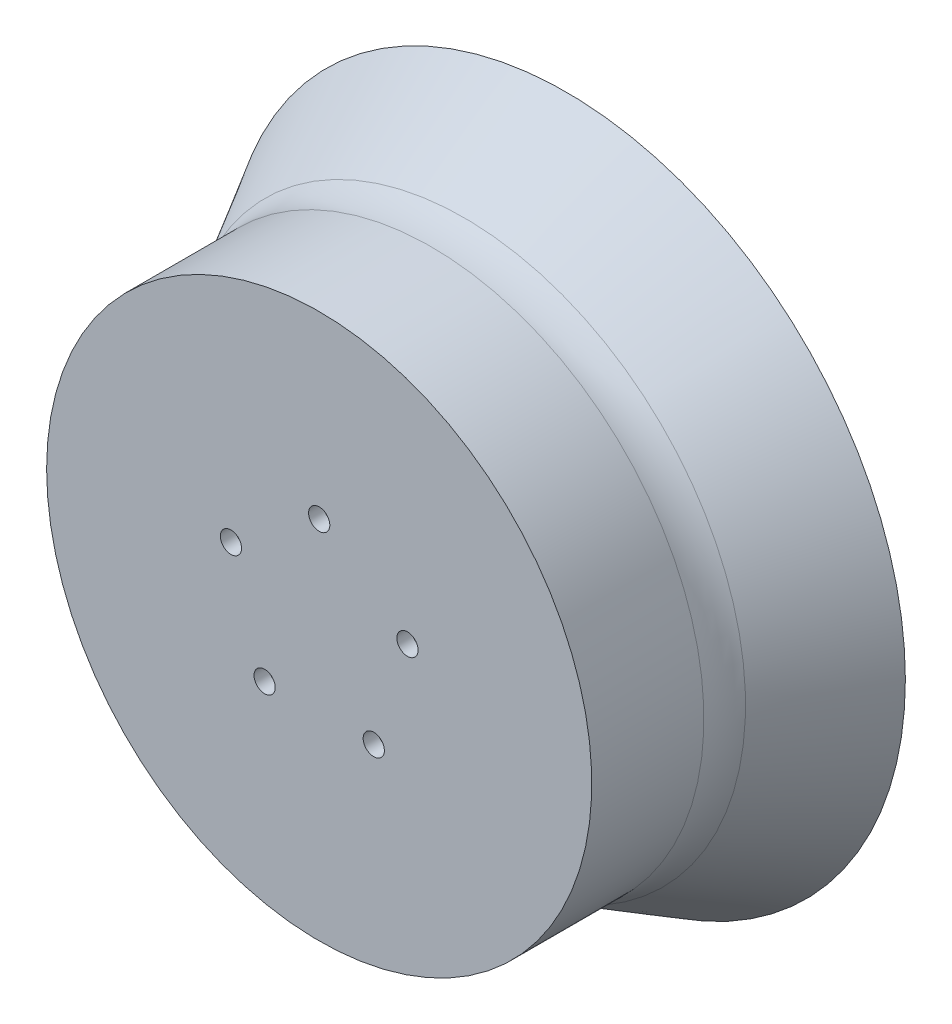
ISO-10303-21;
HEADER;
FILE_DESCRIPTION(('STEP AP214'),'2;1');
FILE_NAME('part.step','',(''),(''),'','','');
FILE_SCHEMA(('AUTOMOTIVE_DESIGN { 1 0 10303 214 1 1 1 1 }'));
ENDSEC;
DATA;
#1=APPLICATION_CONTEXT('core data for automotive mechanical design processes');
#2=APPLICATION_PROTOCOL_DEFINITION('international standard','automotive_design',2000,#1);
#3=PRODUCT_CONTEXT('',#1,'mechanical');
#4=PRODUCT('Part','Part','',(#3));
#5=PRODUCT_RELATED_PRODUCT_CATEGORY('part','',(#4));
#6=PRODUCT_DEFINITION_FORMATION('','',#4);
#7=PRODUCT_DEFINITION_CONTEXT('part definition',#1,'design');
#8=PRODUCT_DEFINITION('design','',#6,#7);
#9=PRODUCT_DEFINITION_SHAPE('','',#8);
#10=(LENGTH_UNIT() NAMED_UNIT(*) SI_UNIT(.MILLI.,.METRE.));
#11=(NAMED_UNIT(*) PLANE_ANGLE_UNIT() SI_UNIT($,.RADIAN.));
#12=(NAMED_UNIT(*) SI_UNIT($,.STERADIAN.) SOLID_ANGLE_UNIT());
#13=UNCERTAINTY_MEASURE_WITH_UNIT(LENGTH_MEASURE(1.E-05),#10,'distance_accuracy_value','');
#14=(GEOMETRIC_REPRESENTATION_CONTEXT(3) GLOBAL_UNCERTAINTY_ASSIGNED_CONTEXT((#13)) GLOBAL_UNIT_ASSIGNED_CONTEXT((#10,
#11,#12)) REPRESENTATION_CONTEXT('',''));
#15=CARTESIAN_POINT('',(0.,0.,0.));
#16=DIRECTION('',(0.,0.,1.));
#17=DIRECTION('',(1.,0.,0.));
#18=AXIS2_PLACEMENT_3D('',#15,#16,#17);
#19=CARTESIAN_POINT('',(0.,0.,4.72888005241665E-12));
#20=DIRECTION('',(0.,0.,-1.));
#21=DIRECTION('',(-1.,0.,0.));
#22=AXIS2_PLACEMENT_3D('',#19,#20,#21);
#23=CYLINDRICAL_SURFACE('',#22,44.45);
#24=CARTESIAN_POINT('',(0.,0.,25.4));
#25=DIRECTION('',(0.,0.,-1.));
#26=DIRECTION('',(-1.,0.,0.));
#27=AXIS2_PLACEMENT_3D('',#24,#25,#26);
#28=CIRCLE('',#27,44.45);
#29=CARTESIAN_POINT('',(-44.45,0.,25.4));
#30=VERTEX_POINT('',#29);
#31=EDGE_CURVE('E69',#30,#30,#28,.T.);
#32=ORIENTED_EDGE('',*,*,#31,.F.);
#33=EDGE_LOOP('',(#32));
#34=FACE_BOUND('',#33,.T.);
#35=CARTESIAN_POINT('',(0.,0.,0.));
#36=DIRECTION('',(0.,0.,-1.));
#37=DIRECTION('',(-1.,0.,0.));
#38=AXIS2_PLACEMENT_3D('',#35,#36,#37);
#39=CIRCLE('',#38,44.45);
#40=CARTESIAN_POINT('',(-44.45,0.,0.));
#41=VERTEX_POINT('',#40);
#42=EDGE_CURVE('E10',#41,#41,#39,.T.);
#43=ORIENTED_EDGE('',*,*,#42,.T.);
#44=EDGE_LOOP('',(#43));
#45=FACE_BOUND('',#44,.T.);
#46=ADVANCED_FACE('F39',(#34,#45),#23,.F.);
#47=CARTESIAN_POINT('',(44.45,0.,0.));
#48=DIRECTION('',(0.,0.,1.));
#49=DIRECTION('',(1.,0.,0.));
#50=AXIS2_PLACEMENT_3D('',#47,#48,#49);
#51=PLANE('',#50);
#52=ORIENTED_EDGE('',*,*,#42,.F.);
#53=EDGE_LOOP('',(#52));
#54=FACE_BOUND('',#53,.T.);
#55=CARTESIAN_POINT('',(0.,0.,0.));
#56=DIRECTION('',(0.,0.,-1.));
#57=DIRECTION('',(-1.,0.,0.));
#58=AXIS2_PLACEMENT_3D('',#55,#56,#57);
#59=CIRCLE('',#58,46.99);
#60=CARTESIAN_POINT('',(-46.99,0.,0.));
#61=VERTEX_POINT('',#60);
#62=EDGE_CURVE('E46',#61,#61,#59,.T.);
#63=ORIENTED_EDGE('',*,*,#62,.T.);
#64=EDGE_LOOP('',(#63));
#65=FACE_BOUND('',#64,.T.);
#66=ADVANCED_FACE('F134',(#54,#65),#51,.F.);
#67=CARTESIAN_POINT('',(0.,0.,-14.6339739445125));
#68=DIRECTION('',(0.,0.,-1.));
#69=DIRECTION('',(-1.,0.,0.));
#70=AXIS2_PLACEMENT_3D('',#67,#68,#69);
#71=CONICAL_SURFACE('',#70,58.473357526,0.665345105019983);
#72=ORIENTED_EDGE('',*,*,#62,.F.);
#73=EDGE_LOOP('',(#72));
#74=FACE_BOUND('',#73,.T.);
#75=CARTESIAN_POINT('',(0.,0.,-14.6339739445125));
#76=DIRECTION('',(0.,0.,-1.));
#77=DIRECTION('',(-1.,0.,0.));
#78=AXIS2_PLACEMENT_3D('',#75,#76,#77);
#79=CIRCLE('',#78,58.473357526);
#80=CARTESIAN_POINT('',(-58.473357526,0.,-14.6339739445125));
#81=VERTEX_POINT('',#80);
#82=EDGE_CURVE('E51',#81,#81,#79,.T.);
#83=ORIENTED_EDGE('',*,*,#82,.T.);
#84=EDGE_LOOP('',(#83));
#85=FACE_BOUND('',#84,.T.);
#86=ADVANCED_FACE('F100',(#74,#85),#71,.F.);
#87=CARTESIAN_POINT('',(0.,0.,2.93998396000001));
#88=DIRECTION('',(0.,0.,-1.));
#89=DIRECTION('',(-1.,0.,0.));
#90=AXIS2_PLACEMENT_3D('',#87,#88,#89);
#91=CONICAL_SURFACE('',#90,48.4888960022749,0.51666322785809);
#92=ORIENTED_EDGE('',*,*,#82,.F.);
#93=EDGE_LOOP('',(#92));
#94=FACE_BOUND('',#93,.T.);
#95=CARTESIAN_POINT('',(0.,0.,2.93998396000001));
#96=DIRECTION('',(0.,0.,-1.));
#97=DIRECTION('',(-1.,0.,0.));
#98=AXIS2_PLACEMENT_3D('',#95,#96,#97);
#99=CIRCLE('',#98,48.4888960022749);
#100=CARTESIAN_POINT('',(-48.4888960022749,0.,2.93998396000001));
#101=VERTEX_POINT('',#100);
#102=EDGE_CURVE('E95',#101,#101,#99,.T.);
#103=ORIENTED_EDGE('',*,*,#102,.T.);
#104=EDGE_LOOP('',(#103));
#105=FACE_BOUND('',#104,.T.);
#106=ADVANCED_FACE('F102',(#94,#105),#91,.T.);
#107=CARTESIAN_POINT('',(0.,0.,8.61255199848089));
#108=DIRECTION('',(0.,0.,-1.));
#109=DIRECTION('',(-1.,0.,0.));
#110=AXIS2_PLACEMENT_3D('',#107,#108,#109);
#111=TOROIDAL_SURFACE('',#110,58.473357526,11.483357526);
#112=ORIENTED_EDGE('',*,*,#102,.F.);
#113=EDGE_LOOP('',(#112));
#114=FACE_BOUND('',#113,.T.);
#115=CARTESIAN_POINT('',(0.,0.,8.61255199848089));
#116=DIRECTION('',(0.,0.,-1.));
#117=DIRECTION('',(-1.,0.,0.));
#118=AXIS2_PLACEMENT_3D('',#115,#116,#117);
#119=CIRCLE('',#118,46.99);
#120=CARTESIAN_POINT('',(-46.99,0.,8.61255199848089));
#121=VERTEX_POINT('',#120);
#122=EDGE_CURVE('E92',#121,#121,#119,.T.);
#123=ORIENTED_EDGE('',*,*,#122,.T.);
#124=EDGE_LOOP('',(#123));
#125=FACE_BOUND('',#124,.T.);
#126=ADVANCED_FACE('F105',(#114,#125),#111,.F.);
#127=CARTESIAN_POINT('',(0.,0.,4.72888005241665E-12));
#128=DIRECTION('',(0.,0.,-1.));
#129=DIRECTION('',(-1.,0.,0.));
#130=AXIS2_PLACEMENT_3D('',#127,#128,#129);
#131=CYLINDRICAL_SURFACE('',#130,46.99);
#132=ORIENTED_EDGE('',*,*,#122,.F.);
#133=EDGE_LOOP('',(#132));
#134=FACE_BOUND('',#133,.T.);
#135=CARTESIAN_POINT('',(0.,0.,27.94));
#136=DIRECTION('',(0.,0.,-1.));
#137=DIRECTION('',(-1.,0.,0.));
#138=AXIS2_PLACEMENT_3D('',#135,#136,#137);
#139=CIRCLE('',#138,46.99);
#140=CARTESIAN_POINT('',(-46.99,0.,27.94));
#141=VERTEX_POINT('',#140);
#142=EDGE_CURVE('E89',#141,#141,#139,.T.);
#143=ORIENTED_EDGE('',*,*,#142,.T.);
#144=EDGE_LOOP('',(#143));
#145=FACE_BOUND('',#144,.T.);
#146=ADVANCED_FACE('F111',(#134,#145),#131,.T.);
#147=CARTESIAN_POINT('',(0.,0.,27.94));
#148=DIRECTION('',(0.,0.,-1.));
#149=DIRECTION('',(-1.,0.,0.));
#150=AXIS2_PLACEMENT_3D('',#147,#148,#149);
#151=PLANE('',#150);
#152=CARTESIAN_POINT('',(-15.2169042607225,4.94427190999912,27.94));
#153=DIRECTION('',(0.,0.,1.));
#154=DIRECTION('',(1.,0.,0.));
#155=AXIS2_PLACEMENT_3D('',#152,#153,#154);
#156=CIRCLE('',#155,1.8288);
#157=CARTESIAN_POINT('',(-13.3881042607225,4.94427190999912,27.94));
#158=VERTEX_POINT('',#157);
#159=EDGE_CURVE('E59',#158,#158,#156,.T.);
#160=ORIENTED_EDGE('',*,*,#159,.F.);
#161=EDGE_LOOP('',(#160));
#162=FACE_BOUND('',#161,.T.);
#163=CARTESIAN_POINT('',(0.,16.,27.94));
#164=DIRECTION('',(0.,0.,1.));
#165=DIRECTION('',(1.,0.,0.));
#166=AXIS2_PLACEMENT_3D('',#163,#164,#165);
#167=CIRCLE('',#166,1.8288);
#168=CARTESIAN_POINT('',(1.8288,16.,27.94));
#169=VERTEX_POINT('',#168);
#170=EDGE_CURVE('E333',#169,#169,#167,.T.);
#171=ORIENTED_EDGE('',*,*,#170,.F.);
#172=EDGE_LOOP('',(#171));
#173=FACE_BOUND('',#172,.T.);
#174=CARTESIAN_POINT('',(-9.4045640366795,-12.9442719099992,27.94));
#175=DIRECTION('',(0.,0.,1.));
#176=DIRECTION('',(1.,0.,0.));
#177=AXIS2_PLACEMENT_3D('',#174,#175,#176);
#178=CIRCLE('',#177,1.8288);
#179=CARTESIAN_POINT('',(-7.5757640366795,-12.9442719099992,27.94));
#180=VERTEX_POINT('',#179);
#181=EDGE_CURVE('E336',#180,#180,#178,.T.);
#182=ORIENTED_EDGE('',*,*,#181,.F.);
#183=EDGE_LOOP('',(#182));
#184=FACE_BOUND('',#183,.T.);
#185=CARTESIAN_POINT('',(9.40456403667968,-12.9442719099991,27.94));
#186=DIRECTION('',(0.,0.,1.));
#187=DIRECTION('',(1.,0.,0.));
#188=AXIS2_PLACEMENT_3D('',#185,#186,#187);
#189=CIRCLE('',#188,1.8288);
#190=CARTESIAN_POINT('',(11.2333640366797,-12.9442719099991,27.94));
#191=VERTEX_POINT('',#190);
#192=EDGE_CURVE('E340',#191,#191,#189,.T.);
#193=ORIENTED_EDGE('',*,*,#192,.F.);
#194=EDGE_LOOP('',(#193));
#195=FACE_BOUND('',#194,.T.);
#196=CARTESIAN_POINT('',(15.2169042607224,4.94427190999933,27.94));
#197=DIRECTION('',(0.,0.,1.));
#198=DIRECTION('',(1.,0.,0.));
#199=AXIS2_PLACEMENT_3D('',#196,#197,#198);
#200=CIRCLE('',#199,1.8288);
#201=CARTESIAN_POINT('',(17.0457042607224,4.94427190999933,27.94));
#202=VERTEX_POINT('',#201);
#203=EDGE_CURVE('E81',#202,#202,#200,.T.);
#204=ORIENTED_EDGE('',*,*,#203,.F.);
#205=EDGE_LOOP('',(#204));
#206=FACE_BOUND('',#205,.T.);
#207=ORIENTED_EDGE('',*,*,#142,.F.);
#208=EDGE_LOOP('',(#207));
#209=FACE_BOUND('',#208,.T.);
#210=ADVANCED_FACE('F117',(#162,#173,#184,#195,#206,#209),#151,.F.);
#211=CARTESIAN_POINT('',(5.4229,0.,15.24));
#212=DIRECTION('',(0.,0.,1.));
#213=DIRECTION('',(1.,0.,0.));
#214=AXIS2_PLACEMENT_3D('',#211,#212,#213);
#215=PLANE('',#214);
#216=CARTESIAN_POINT('',(0.,0.,15.24));
#217=DIRECTION('',(0.,0.,-1.));
#218=DIRECTION('',(-1.,0.,0.));
#219=AXIS2_PLACEMENT_3D('',#216,#217,#218);
#220=CIRCLE('',#219,5.4229);
#221=CARTESIAN_POINT('',(-5.4229,0.,15.24));
#222=VERTEX_POINT('',#221);
#223=EDGE_CURVE('E86',#222,#222,#220,.T.);
#224=ORIENTED_EDGE('',*,*,#223,.T.);
#225=EDGE_LOOP('',(#224));
#226=FACE_BOUND('',#225,.T.);
#227=ADVANCED_FACE('F122',(#226),#215,.F.);
#228=CARTESIAN_POINT('',(0.,0.,17.78));
#229=DIRECTION('',(0.,0.,1.));
#230=DIRECTION('',(1.,0.,0.));
#231=AXIS2_PLACEMENT_3D('',#228,#229,#230);
#232=CONICAL_SURFACE('',#231,7.9629,0.785398163397444);
#233=ORIENTED_EDGE('',*,*,#223,.F.);
#234=EDGE_LOOP('',(#233));
#235=FACE_BOUND('',#234,.T.);
#236=CARTESIAN_POINT('',(0.,0.,17.78));
#237=DIRECTION('',(0.,0.,-1.));
#238=DIRECTION('',(-1.,0.,0.));
#239=AXIS2_PLACEMENT_3D('',#236,#237,#238);
#240=CIRCLE('',#239,7.9629);
#241=CARTESIAN_POINT('',(-7.9629,0.,17.78));
#242=VERTEX_POINT('',#241);
#243=EDGE_CURVE('E78',#242,#242,#240,.T.);
#244=ORIENTED_EDGE('',*,*,#243,.T.);
#245=EDGE_LOOP('',(#244));
#246=FACE_BOUND('',#245,.T.);
#247=ADVANCED_FACE('F128',(#235,#246),#232,.T.);
#248=CARTESIAN_POINT('',(0.,0.,4.72888005241665E-12));
#249=DIRECTION('',(0.,0.,-1.));
#250=DIRECTION('',(-1.,0.,0.));
#251=AXIS2_PLACEMENT_3D('',#248,#249,#250);
#252=CYLINDRICAL_SURFACE('',#251,7.9629);
#253=ORIENTED_EDGE('',*,*,#243,.F.);
#254=EDGE_LOOP('',(#253));
#255=FACE_BOUND('',#254,.T.);
#256=CARTESIAN_POINT('',(0.,0.,25.4));
#257=DIRECTION('',(0.,0.,-1.));
#258=DIRECTION('',(-1.,0.,0.));
#259=AXIS2_PLACEMENT_3D('',#256,#257,#258);
#260=CIRCLE('',#259,7.9629);
#261=CARTESIAN_POINT('',(-7.96289999999999,0.,25.4));
#262=VERTEX_POINT('',#261);
#263=EDGE_CURVE('E73',#262,#262,#260,.T.);
#264=ORIENTED_EDGE('',*,*,#263,.T.);
#265=EDGE_LOOP('',(#264));
#266=FACE_BOUND('',#265,.T.);
#267=ADVANCED_FACE('F182',(#255,#266),#252,.T.);
#268=CARTESIAN_POINT('',(7.9629,0.,25.4));
#269=DIRECTION('',(0.,0.,1.));
#270=DIRECTION('',(1.,0.,0.));
#271=AXIS2_PLACEMENT_3D('',#268,#269,#270);
#272=PLANE('',#271);
#273=CARTESIAN_POINT('',(-15.2169042607225,4.94427190999912,25.4));
#274=DIRECTION('',(0.,0.,1.));
#275=DIRECTION('',(1.,0.,0.));
#276=AXIS2_PLACEMENT_3D('',#273,#274,#275);
#277=CIRCLE('',#276,1.8288);
#278=CARTESIAN_POINT('',(-13.3881042607225,4.94427190999912,25.4));
#279=VERTEX_POINT('',#278);
#280=EDGE_CURVE('E42',#279,#279,#277,.T.);
#281=ORIENTED_EDGE('',*,*,#280,.T.);
#282=EDGE_LOOP('',(#281));
#283=FACE_BOUND('',#282,.T.);
#284=CARTESIAN_POINT('',(0.,16.,25.4));
#285=DIRECTION('',(0.,0.,1.));
#286=DIRECTION('',(1.,0.,0.));
#287=AXIS2_PLACEMENT_3D('',#284,#285,#286);
#288=CIRCLE('',#287,1.8288);
#289=CARTESIAN_POINT('',(1.8288,16.,25.4));
#290=VERTEX_POINT('',#289);
#291=EDGE_CURVE('E64',#290,#290,#288,.T.);
#292=ORIENTED_EDGE('',*,*,#291,.T.);
#293=EDGE_LOOP('',(#292));
#294=FACE_BOUND('',#293,.T.);
#295=CARTESIAN_POINT('',(-9.4045640366795,-12.9442719099992,25.4));
#296=DIRECTION('',(0.,0.,1.));
#297=DIRECTION('',(1.,0.,0.));
#298=AXIS2_PLACEMENT_3D('',#295,#296,#297);
#299=CIRCLE('',#298,1.8288);
#300=CARTESIAN_POINT('',(-7.5757640366795,-12.9442719099992,25.4));
#301=VERTEX_POINT('',#300);
#302=EDGE_CURVE('E62',#301,#301,#299,.T.);
#303=ORIENTED_EDGE('',*,*,#302,.T.);
#304=EDGE_LOOP('',(#303));
#305=FACE_BOUND('',#304,.T.);
#306=CARTESIAN_POINT('',(9.40456403667968,-12.9442719099991,25.4));
#307=DIRECTION('',(0.,0.,1.));
#308=DIRECTION('',(1.,0.,0.));
#309=AXIS2_PLACEMENT_3D('',#306,#307,#308);
#310=CIRCLE('',#309,1.8288);
#311=CARTESIAN_POINT('',(11.2333640366797,-12.9442719099991,25.4));
#312=VERTEX_POINT('',#311);
#313=EDGE_CURVE('E58',#312,#312,#310,.T.);
#314=ORIENTED_EDGE('',*,*,#313,.T.);
#315=EDGE_LOOP('',(#314));
#316=FACE_BOUND('',#315,.T.);
#317=CARTESIAN_POINT('',(15.2169042607224,4.94427190999933,25.4));
#318=DIRECTION('',(0.,0.,1.));
#319=DIRECTION('',(1.,0.,0.));
#320=AXIS2_PLACEMENT_3D('',#317,#318,#319);
#321=CIRCLE('',#320,1.8288);
#322=CARTESIAN_POINT('',(17.0457042607224,4.94427190999933,25.4));
#323=VERTEX_POINT('',#322);
#324=EDGE_CURVE('E55',#323,#323,#321,.T.);
#325=ORIENTED_EDGE('',*,*,#324,.T.);
#326=EDGE_LOOP('',(#325));
#327=FACE_BOUND('',#326,.T.);
#328=ORIENTED_EDGE('',*,*,#263,.F.);
#329=EDGE_LOOP('',(#328));
#330=FACE_BOUND('',#329,.T.);
#331=ORIENTED_EDGE('',*,*,#31,.T.);
#332=EDGE_LOOP('',(#331));
#333=FACE_BOUND('',#332,.T.);
#334=ADVANCED_FACE('F191',(#283,#294,#305,#316,#327,#330,#333),#272,.F.);
#335=CARTESIAN_POINT('',(15.2169042607224,4.94427190999933,-14.6339739445125));
#336=DIRECTION('',(0.,0.,1.));
#337=DIRECTION('',(1.,0.,0.));
#338=AXIS2_PLACEMENT_3D('',#335,#336,#337);
#339=CYLINDRICAL_SURFACE('',#338,1.8288);
#340=ORIENTED_EDGE('',*,*,#203,.T.);
#341=EDGE_LOOP('',(#340));
#342=FACE_BOUND('',#341,.T.);
#343=ORIENTED_EDGE('',*,*,#324,.F.);
#344=EDGE_LOOP('',(#343));
#345=FACE_BOUND('',#344,.T.);
#346=ADVANCED_FACE('F200',(#342,#345),#339,.F.);
#347=CARTESIAN_POINT('',(9.40456403667968,-12.9442719099991,-14.6339739445125));
#348=DIRECTION('',(0.,0.,1.));
#349=DIRECTION('',(1.,0.,0.));
#350=AXIS2_PLACEMENT_3D('',#347,#348,#349);
#351=CYLINDRICAL_SURFACE('',#350,1.8288);
#352=ORIENTED_EDGE('',*,*,#192,.T.);
#353=EDGE_LOOP('',(#352));
#354=FACE_BOUND('',#353,.T.);
#355=ORIENTED_EDGE('',*,*,#313,.F.);
#356=EDGE_LOOP('',(#355));
#357=FACE_BOUND('',#356,.T.);
#358=ADVANCED_FACE('F209',(#354,#357),#351,.F.);
#359=CARTESIAN_POINT('',(-9.4045640366795,-12.9442719099992,-14.6339739445125));
#360=DIRECTION('',(0.,0.,1.));
#361=DIRECTION('',(1.,0.,0.));
#362=AXIS2_PLACEMENT_3D('',#359,#360,#361);
#363=CYLINDRICAL_SURFACE('',#362,1.8288);
#364=ORIENTED_EDGE('',*,*,#181,.T.);
#365=EDGE_LOOP('',(#364));
#366=FACE_BOUND('',#365,.T.);
#367=ORIENTED_EDGE('',*,*,#302,.F.);
#368=EDGE_LOOP('',(#367));
#369=FACE_BOUND('',#368,.T.);
#370=ADVANCED_FACE('F219',(#366,#369),#363,.F.);
#371=CARTESIAN_POINT('',(0.,16.,-14.6339739445125));
#372=DIRECTION('',(0.,0.,1.));
#373=DIRECTION('',(1.,0.,0.));
#374=AXIS2_PLACEMENT_3D('',#371,#372,#373);
#375=CYLINDRICAL_SURFACE('',#374,1.8288);
#376=ORIENTED_EDGE('',*,*,#170,.T.);
#377=EDGE_LOOP('',(#376));
#378=FACE_BOUND('',#377,.T.);
#379=ORIENTED_EDGE('',*,*,#291,.F.);
#380=EDGE_LOOP('',(#379));
#381=FACE_BOUND('',#380,.T.);
#382=ADVANCED_FACE('F229',(#378,#381),#375,.F.);
#383=CARTESIAN_POINT('',(-15.2169042607225,4.94427190999912,-14.6339739445125));
#384=DIRECTION('',(0.,0.,1.));
#385=DIRECTION('',(1.,0.,0.));
#386=AXIS2_PLACEMENT_3D('',#383,#384,#385);
#387=CYLINDRICAL_SURFACE('',#386,1.8288);
#388=ORIENTED_EDGE('',*,*,#159,.T.);
#389=EDGE_LOOP('',(#388));
#390=FACE_BOUND('',#389,.T.);
#391=ORIENTED_EDGE('',*,*,#280,.F.);
#392=EDGE_LOOP('',(#391));
#393=FACE_BOUND('',#392,.T.);
#394=ADVANCED_FACE('F239',(#390,#393),#387,.F.);
#395=CLOSED_SHELL('',(#46,#66,#86,#106,#126,#146,#210,#227,#247,#267,#334,#346,#358,#370,#382,#394));
#396=MANIFOLD_SOLID_BREP('B2',#395);
#397=ADVANCED_BREP_SHAPE_REPRESENTATION('',(#18,#396),#14);
#398=SHAPE_DEFINITION_REPRESENTATION(#9,#397);
ENDSEC;
END-ISO-10303-21;
